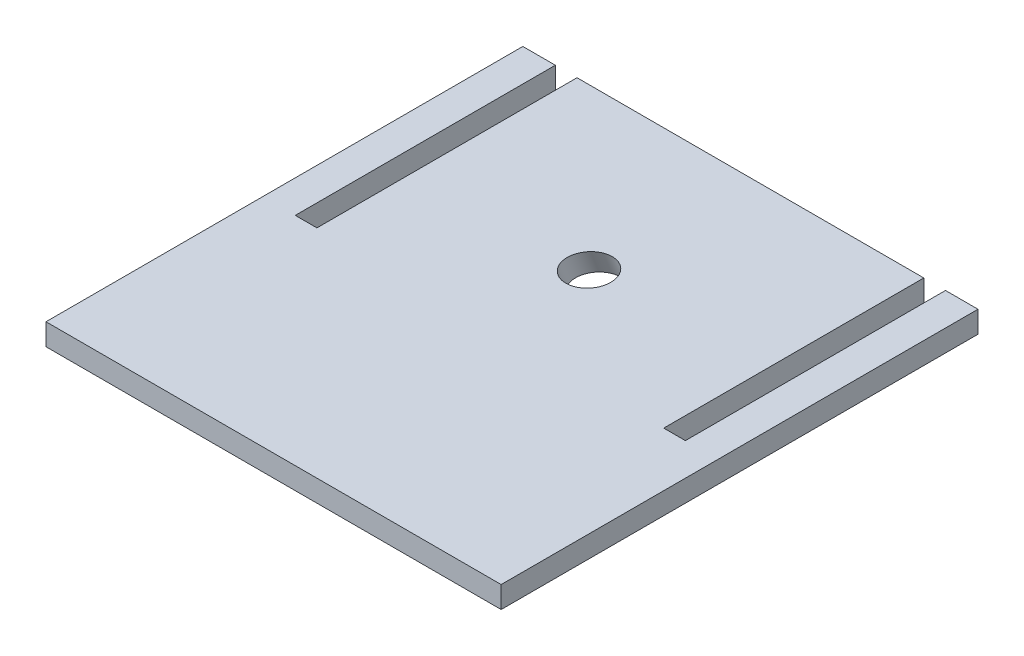
ISO-10303-21;
HEADER;
FILE_DESCRIPTION(('STEP AP214'),'2;1');
FILE_NAME('part.step','',(''),(''),'','','');
FILE_SCHEMA(('AUTOMOTIVE_DESIGN { 1 0 10303 214 1 1 1 1 }'));
ENDSEC;
DATA;
#1=APPLICATION_CONTEXT('core data for automotive mechanical design processes');
#2=APPLICATION_PROTOCOL_DEFINITION('international standard','automotive_design',2000,#1);
#3=PRODUCT_CONTEXT('',#1,'mechanical');
#4=PRODUCT('Part','Part','',(#3));
#5=PRODUCT_RELATED_PRODUCT_CATEGORY('part','',(#4));
#6=PRODUCT_DEFINITION_FORMATION('','',#4);
#7=PRODUCT_DEFINITION_CONTEXT('part definition',#1,'design');
#8=PRODUCT_DEFINITION('design','',#6,#7);
#9=PRODUCT_DEFINITION_SHAPE('','',#8);
#10=(LENGTH_UNIT() NAMED_UNIT(*) SI_UNIT(.MILLI.,.METRE.));
#11=(NAMED_UNIT(*) PLANE_ANGLE_UNIT() SI_UNIT($,.RADIAN.));
#12=(NAMED_UNIT(*) SI_UNIT($,.STERADIAN.) SOLID_ANGLE_UNIT());
#13=UNCERTAINTY_MEASURE_WITH_UNIT(LENGTH_MEASURE(1.E-05),#10,'distance_accuracy_value','');
#14=(GEOMETRIC_REPRESENTATION_CONTEXT(3) GLOBAL_UNCERTAINTY_ASSIGNED_CONTEXT((#13)) GLOBAL_UNIT_ASSIGNED_CONTEXT((#10,
#11,#12)) REPRESENTATION_CONTEXT('',''));
#15=CARTESIAN_POINT('',(0.,0.,0.));
#16=DIRECTION('',(0.,0.,1.));
#17=DIRECTION('',(1.,0.,0.));
#18=AXIS2_PLACEMENT_3D('',#15,#16,#17);
#19=CARTESIAN_POINT('',(-165.1,6.35,-139.7));
#20=DIRECTION('',(0.,0.,1.));
#21=DIRECTION('',(1.,0.,0.));
#22=AXIS2_PLACEMENT_3D('',#19,#20,#21);
#23=PLANE('',#22);
#24=DIRECTION('',(-1.,0.,0.));
#25=VECTOR('',#24,1.);
#26=CARTESIAN_POINT('',(-165.1,-6.35,-139.7));
#27=LINE('',#26,#25);
#28=CARTESIAN_POINT('',(-114.3,-6.35,-139.7));
#29=VERTEX_POINT('',#28);
#30=CARTESIAN_POINT('',(-133.35,-6.35,-139.7));
#31=VERTEX_POINT('',#30);
#32=EDGE_CURVE('E158',#29,#31,#27,.T.);
#33=ORIENTED_EDGE('',*,*,#32,.T.);
#34=DIRECTION('',(0.,1.,0.));
#35=VECTOR('',#34,1.);
#36=CARTESIAN_POINT('',(-133.35,-6.35,-139.7));
#37=LINE('',#36,#35);
#38=CARTESIAN_POINT('',(-133.35,6.35,-139.7));
#39=VERTEX_POINT('',#38);
#40=EDGE_CURVE('E147',#31,#39,#37,.T.);
#41=ORIENTED_EDGE('',*,*,#40,.T.);
#42=DIRECTION('',(-1.,0.,0.));
#43=VECTOR('',#42,1.);
#44=CARTESIAN_POINT('',(-165.1,6.35,-139.7));
#45=LINE('',#44,#43);
#46=CARTESIAN_POINT('',(-114.3,6.35,-139.7));
#47=VERTEX_POINT('',#46);
#48=EDGE_CURVE('E243',#47,#39,#45,.T.);
#49=ORIENTED_EDGE('',*,*,#48,.F.);
#50=DIRECTION('',(0.,1.,0.));
#51=VECTOR('',#50,1.);
#52=CARTESIAN_POINT('',(-114.3,-6.35,-139.7));
#53=LINE('',#52,#51);
#54=EDGE_CURVE('E172',#29,#47,#53,.T.);
#55=ORIENTED_EDGE('',*,*,#54,.F.);
#56=EDGE_LOOP('',(#33,#41,#49,#55));
#57=FACE_BOUND('',#56,.T.);
#58=ADVANCED_FACE('F43',(#57),#23,.F.);
#59=CARTESIAN_POINT('',(133.35,6.35,-139.7));
#60=VERTEX_POINT('',#59);
#61=CARTESIAN_POINT('',(114.3,6.35,-139.7));
#62=VERTEX_POINT('',#61);
#63=EDGE_CURVE('E253',#60,#62,#45,.T.);
#64=ORIENTED_EDGE('',*,*,#63,.F.);
#65=DIRECTION('',(0.,1.,0.));
#66=VECTOR('',#65,1.);
#67=CARTESIAN_POINT('',(133.35,-6.35,-139.7));
#68=LINE('',#67,#66);
#69=CARTESIAN_POINT('',(133.35,-6.35,-139.7));
#70=VERTEX_POINT('',#69);
#71=EDGE_CURVE('E239',#70,#60,#68,.T.);
#72=ORIENTED_EDGE('',*,*,#71,.F.);
#73=CARTESIAN_POINT('',(114.3,-6.35,-139.7));
#74=VERTEX_POINT('',#73);
#75=EDGE_CURVE('E157',#70,#74,#27,.T.);
#76=ORIENTED_EDGE('',*,*,#75,.T.);
#77=DIRECTION('',(0.,1.,0.));
#78=VECTOR('',#77,1.);
#79=CARTESIAN_POINT('',(114.3,-6.35,-139.7));
#80=LINE('',#79,#78);
#81=EDGE_CURVE('E182',#74,#62,#80,.T.);
#82=ORIENTED_EDGE('',*,*,#81,.T.);
#83=EDGE_LOOP('',(#64,#72,#76,#82));
#84=FACE_BOUND('',#83,.T.);
#85=ADVANCED_FACE('F322',(#84),#23,.F.);
#86=CARTESIAN_POINT('',(101.6,-6.35,-139.7));
#87=VERTEX_POINT('',#86);
#88=CARTESIAN_POINT('',(-101.6,-6.35,-139.7));
#89=VERTEX_POINT('',#88);
#90=EDGE_CURVE('E175',#87,#89,#27,.T.);
#91=ORIENTED_EDGE('',*,*,#90,.T.);
#92=DIRECTION('',(0.,1.,0.));
#93=VECTOR('',#92,1.);
#94=CARTESIAN_POINT('',(-101.6,-6.35,-139.7));
#95=LINE('',#94,#93);
#96=CARTESIAN_POINT('',(-101.6,6.35,-139.7));
#97=VERTEX_POINT('',#96);
#98=EDGE_CURVE('E181',#89,#97,#95,.T.);
#99=ORIENTED_EDGE('',*,*,#98,.T.);
#100=CARTESIAN_POINT('',(101.6,6.35,-139.7));
#101=VERTEX_POINT('',#100);
#102=EDGE_CURVE('E255',#101,#97,#45,.T.);
#103=ORIENTED_EDGE('',*,*,#102,.F.);
#104=DIRECTION('',(0.,1.,0.));
#105=VECTOR('',#104,1.);
#106=CARTESIAN_POINT('',(101.6,-6.35,-139.7));
#107=LINE('',#106,#105);
#108=EDGE_CURVE('E196',#87,#101,#107,.T.);
#109=ORIENTED_EDGE('',*,*,#108,.F.);
#110=EDGE_LOOP('',(#91,#99,#103,#109));
#111=FACE_BOUND('',#110,.T.);
#112=ADVANCED_FACE('F300',(#111),#23,.F.);
#113=CARTESIAN_POINT('',(-165.1,6.35,139.7));
#114=DIRECTION('',(0.,0.,-1.));
#115=DIRECTION('',(-1.,0.,0.));
#116=AXIS2_PLACEMENT_3D('',#113,#114,#115);
#117=PLANE('',#116);
#118=DIRECTION('',(1.,0.,0.));
#119=VECTOR('',#118,1.);
#120=CARTESIAN_POINT('',(-165.1,6.35,139.7));
#121=LINE('',#120,#119);
#122=CARTESIAN_POINT('',(-133.35,6.35,139.7));
#123=VERTEX_POINT('',#122);
#124=CARTESIAN_POINT('',(133.35,6.35,139.7));
#125=VERTEX_POINT('',#124);
#126=EDGE_CURVE('E250',#123,#125,#121,.T.);
#127=ORIENTED_EDGE('',*,*,#126,.F.);
#128=DIRECTION('',(0.,1.,0.));
#129=VECTOR('',#128,1.);
#130=CARTESIAN_POINT('',(-133.35,-6.35,139.7));
#131=LINE('',#130,#129);
#132=CARTESIAN_POINT('',(-133.35,-6.35,139.7));
#133=VERTEX_POINT('',#132);
#134=EDGE_CURVE('E53',#133,#123,#131,.T.);
#135=ORIENTED_EDGE('',*,*,#134,.F.);
#136=DIRECTION('',(1.,0.,0.));
#137=VECTOR('',#136,1.);
#138=CARTESIAN_POINT('',(-165.1,-6.35,139.7));
#139=LINE('',#138,#137);
#140=CARTESIAN_POINT('',(133.35,-6.35,139.7));
#141=VERTEX_POINT('',#140);
#142=EDGE_CURVE('E167',#133,#141,#139,.T.);
#143=ORIENTED_EDGE('',*,*,#142,.T.);
#144=DIRECTION('',(0.,1.,0.));
#145=VECTOR('',#144,1.);
#146=CARTESIAN_POINT('',(133.35,-6.35,139.7));
#147=LINE('',#146,#145);
#148=EDGE_CURVE('E240',#141,#125,#147,.T.);
#149=ORIENTED_EDGE('',*,*,#148,.T.);
#150=EDGE_LOOP('',(#127,#135,#143,#149));
#151=FACE_BOUND('',#150,.T.);
#152=ADVANCED_FACE('F329',(#151),#117,.F.);
#153=CARTESIAN_POINT('',(0.,6.35,0.));
#154=DIRECTION('',(0.,-1.,0.));
#155=DIRECTION('',(0.,0.,-1.));
#156=AXIS2_PLACEMENT_3D('',#153,#154,#155);
#157=PLANE('',#156);
#158=CARTESIAN_POINT('',(-0.577885440566899,6.34999999999999,-45.697273091108));
#159=DIRECTION('',(0.,-1.,0.));
#160=DIRECTION('',(-0.0211224465512653,0.,0.9997768962382));
#161=AXIS2_PLACEMENT_3D('',#158,#159,#160);
#162=ELLIPSE('',#161,13.5685983777433,12.7);
#163=CARTESIAN_POINT('',(-0.864487434576367,6.34999999999999,-32.1317019187052));
#164=VERTEX_POINT('',#163);
#165=EDGE_CURVE('E11',#164,#164,#162,.F.);
#166=ORIENTED_EDGE('',*,*,#165,.F.);
#167=EDGE_LOOP('',(#166));
#168=FACE_BOUND('',#167,.T.);
#169=ORIENTED_EDGE('',*,*,#48,.T.);
#170=DIRECTION('',(0.,0.,-1.));
#171=VECTOR('',#170,1.);
#172=CARTESIAN_POINT('',(-133.35,6.35,-139.7));
#173=LINE('',#172,#171);
#174=EDGE_CURVE('E151',#123,#39,#173,.T.);
#175=ORIENTED_EDGE('',*,*,#174,.F.);
#176=ORIENTED_EDGE('',*,*,#126,.T.);
#177=DIRECTION('',(0.,0.,1.));
#178=VECTOR('',#177,1.);
#179=CARTESIAN_POINT('',(133.35,6.35,-139.7));
#180=LINE('',#179,#178);
#181=EDGE_CURVE('E201',#60,#125,#180,.T.);
#182=ORIENTED_EDGE('',*,*,#181,.F.);
#183=ORIENTED_EDGE('',*,*,#63,.T.);
#184=DIRECTION('',(0.,0.,-1.));
#185=VECTOR('',#184,1.);
#186=CARTESIAN_POINT('',(114.3,6.35,-139.7));
#187=LINE('',#186,#185);
#188=CARTESIAN_POINT('',(114.3,6.35,12.7));
#189=VERTEX_POINT('',#188);
#190=EDGE_CURVE('E235',#189,#62,#187,.T.);
#191=ORIENTED_EDGE('',*,*,#190,.F.);
#192=DIRECTION('',(1.,0.,0.));
#193=VECTOR('',#192,1.);
#194=CARTESIAN_POINT('',(114.3,6.35,12.7));
#195=LINE('',#194,#193);
#196=CARTESIAN_POINT('',(101.6,6.35,12.7));
#197=VERTEX_POINT('',#196);
#198=EDGE_CURVE('E276',#197,#189,#195,.T.);
#199=ORIENTED_EDGE('',*,*,#198,.F.);
#200=DIRECTION('',(0.,0.,1.));
#201=VECTOR('',#200,1.);
#202=CARTESIAN_POINT('',(101.6,6.35,-139.7));
#203=LINE('',#202,#201);
#204=EDGE_CURVE('E282',#101,#197,#203,.T.);
#205=ORIENTED_EDGE('',*,*,#204,.F.);
#206=ORIENTED_EDGE('',*,*,#102,.T.);
#207=DIRECTION('',(0.,0.,-1.));
#208=VECTOR('',#207,1.);
#209=CARTESIAN_POINT('',(-101.6,6.35,-139.7));
#210=LINE('',#209,#208);
#211=CARTESIAN_POINT('',(-101.6,6.35,12.7));
#212=VERTEX_POINT('',#211);
#213=EDGE_CURVE('E206',#212,#97,#210,.T.);
#214=ORIENTED_EDGE('',*,*,#213,.F.);
#215=DIRECTION('',(1.,0.,0.));
#216=VECTOR('',#215,1.);
#217=CARTESIAN_POINT('',(-114.3,6.35,12.7));
#218=LINE('',#217,#216);
#219=CARTESIAN_POINT('',(-114.3,6.35,12.7));
#220=VERTEX_POINT('',#219);
#221=EDGE_CURVE('E202',#220,#212,#218,.T.);
#222=ORIENTED_EDGE('',*,*,#221,.F.);
#223=DIRECTION('',(0.,0.,1.));
#224=VECTOR('',#223,1.);
#225=CARTESIAN_POINT('',(-114.3,6.35,-139.7));
#226=LINE('',#225,#224);
#227=EDGE_CURVE('E212',#47,#220,#226,.T.);
#228=ORIENTED_EDGE('',*,*,#227,.F.);
#229=EDGE_LOOP('',(#169,#175,#176,#182,#183,#191,#199,#205,#206,#214,#222,#228));
#230=FACE_BOUND('',#229,.T.);
#231=ADVANCED_FACE('F45',(#168,#230),#157,.F.);
#232=CARTESIAN_POINT('',(0.,-6.35,0.));
#233=DIRECTION('',(0.,-1.,0.));
#234=DIRECTION('',(0.,0.,-1.));
#235=AXIS2_PLACEMENT_3D('',#232,#233,#234);
#236=PLANE('',#235);
#237=CARTESIAN_POINT('',(-0.476989852233649,-6.35,-50.4729072915838));
#238=DIRECTION('',(0.,-1.,0.));
#239=DIRECTION('',(-0.0211224465512653,0.,0.9997768962382));
#240=AXIS2_PLACEMENT_3D('',#237,#238,#239);
#241=ELLIPSE('',#240,13.5685983777433,12.7);
#242=CARTESIAN_POINT('',(-0.763591846243117,-6.35,-36.9073361191809));
#243=VERTEX_POINT('',#242);
#244=EDGE_CURVE('E170',#243,#243,#241,.F.);
#245=ORIENTED_EDGE('',*,*,#244,.T.);
#246=EDGE_LOOP('',(#245));
#247=FACE_BOUND('',#246,.T.);
#248=DIRECTION('',(0.,0.,-1.));
#249=VECTOR('',#248,1.);
#250=CARTESIAN_POINT('',(-133.35,-6.35,-139.7));
#251=LINE('',#250,#249);
#252=EDGE_CURVE('E150',#133,#31,#251,.T.);
#253=ORIENTED_EDGE('',*,*,#252,.T.);
#254=ORIENTED_EDGE('',*,*,#32,.F.);
#255=DIRECTION('',(0.,0.,1.));
#256=VECTOR('',#255,1.);
#257=CARTESIAN_POINT('',(-114.3,-6.35,-139.7));
#258=LINE('',#257,#256);
#259=CARTESIAN_POINT('',(-114.3,-6.35,12.7));
#260=VERTEX_POINT('',#259);
#261=EDGE_CURVE('E169',#29,#260,#258,.T.);
#262=ORIENTED_EDGE('',*,*,#261,.T.);
#263=DIRECTION('',(1.,0.,0.));
#264=VECTOR('',#263,1.);
#265=CARTESIAN_POINT('',(-114.3,-6.35,12.7));
#266=LINE('',#265,#264);
#267=CARTESIAN_POINT('',(-101.6,-6.35,12.7));
#268=VERTEX_POINT('',#267);
#269=EDGE_CURVE('E226',#260,#268,#266,.T.);
#270=ORIENTED_EDGE('',*,*,#269,.T.);
#271=DIRECTION('',(0.,0.,-1.));
#272=VECTOR('',#271,1.);
#273=CARTESIAN_POINT('',(-101.6,-6.35,-139.7));
#274=LINE('',#273,#272);
#275=EDGE_CURVE('E221',#268,#89,#274,.T.);
#276=ORIENTED_EDGE('',*,*,#275,.T.);
#277=ORIENTED_EDGE('',*,*,#90,.F.);
#278=DIRECTION('',(0.,0.,1.));
#279=VECTOR('',#278,1.);
#280=CARTESIAN_POINT('',(101.6,-6.35,-139.7));
#281=LINE('',#280,#279);
#282=CARTESIAN_POINT('',(101.6,-6.35,12.7));
#283=VERTEX_POINT('',#282);
#284=EDGE_CURVE('E225',#87,#283,#281,.T.);
#285=ORIENTED_EDGE('',*,*,#284,.T.);
#286=DIRECTION('',(1.,0.,0.));
#287=VECTOR('',#286,1.);
#288=CARTESIAN_POINT('',(114.3,-6.35,12.7));
#289=LINE('',#288,#287);
#290=CARTESIAN_POINT('',(114.3,-6.35,12.7));
#291=VERTEX_POINT('',#290);
#292=EDGE_CURVE('E280',#283,#291,#289,.T.);
#293=ORIENTED_EDGE('',*,*,#292,.T.);
#294=DIRECTION('',(0.,0.,-1.));
#295=VECTOR('',#294,1.);
#296=CARTESIAN_POINT('',(114.3,-6.35,-139.7));
#297=LINE('',#296,#295);
#298=EDGE_CURVE('E236',#291,#74,#297,.T.);
#299=ORIENTED_EDGE('',*,*,#298,.T.);
#300=ORIENTED_EDGE('',*,*,#75,.F.);
#301=DIRECTION('',(0.,0.,1.));
#302=VECTOR('',#301,1.);
#303=CARTESIAN_POINT('',(133.35,-6.35,-139.7));
#304=LINE('',#303,#302);
#305=EDGE_CURVE('E232',#70,#141,#304,.T.);
#306=ORIENTED_EDGE('',*,*,#305,.T.);
#307=ORIENTED_EDGE('',*,*,#142,.F.);
#308=EDGE_LOOP('',(#253,#254,#262,#270,#276,#277,#285,#293,#299,#300,#306,#307));
#309=FACE_BOUND('',#308,.T.);
#310=ADVANCED_FACE('F163',(#247,#309),#236,.T.);
#311=CARTESIAN_POINT('',(114.3,-6.35,-139.7));
#312=DIRECTION('',(1.,0.,0.));
#313=DIRECTION('',(0.,0.,-1.));
#314=AXIS2_PLACEMENT_3D('',#311,#312,#313);
#315=PLANE('',#314);
#316=ORIENTED_EDGE('',*,*,#190,.T.);
#317=ORIENTED_EDGE('',*,*,#81,.F.);
#318=ORIENTED_EDGE('',*,*,#298,.F.);
#319=DIRECTION('',(0.,1.,0.));
#320=VECTOR('',#319,1.);
#321=CARTESIAN_POINT('',(114.3,-6.35,12.7));
#322=LINE('',#321,#320);
#323=EDGE_CURVE('E272',#291,#189,#322,.T.);
#324=ORIENTED_EDGE('',*,*,#323,.T.);
#325=EDGE_LOOP('',(#316,#317,#318,#324));
#326=FACE_BOUND('',#325,.T.);
#327=ADVANCED_FACE('F269',(#326),#315,.F.);
#328=CARTESIAN_POINT('',(114.3,-6.35,12.7));
#329=DIRECTION('',(0.,0.,1.));
#330=DIRECTION('',(1.,0.,0.));
#331=AXIS2_PLACEMENT_3D('',#328,#329,#330);
#332=PLANE('',#331);
#333=ORIENTED_EDGE('',*,*,#198,.T.);
#334=ORIENTED_EDGE('',*,*,#323,.F.);
#335=ORIENTED_EDGE('',*,*,#292,.F.);
#336=DIRECTION('',(0.,1.,0.));
#337=VECTOR('',#336,1.);
#338=CARTESIAN_POINT('',(101.6,-6.35,12.7));
#339=LINE('',#338,#337);
#340=EDGE_CURVE('E286',#283,#197,#339,.T.);
#341=ORIENTED_EDGE('',*,*,#340,.T.);
#342=EDGE_LOOP('',(#333,#334,#335,#341));
#343=FACE_BOUND('',#342,.T.);
#344=ADVANCED_FACE('F290',(#343),#332,.F.);
#345=CARTESIAN_POINT('',(101.6,-6.35,-139.7));
#346=DIRECTION('',(-1.,0.,0.));
#347=DIRECTION('',(0.,0.,1.));
#348=AXIS2_PLACEMENT_3D('',#345,#346,#347);
#349=PLANE('',#348);
#350=ORIENTED_EDGE('',*,*,#204,.T.);
#351=ORIENTED_EDGE('',*,*,#340,.F.);
#352=ORIENTED_EDGE('',*,*,#284,.F.);
#353=ORIENTED_EDGE('',*,*,#108,.T.);
#354=EDGE_LOOP('',(#350,#351,#352,#353));
#355=FACE_BOUND('',#354,.T.);
#356=ADVANCED_FACE('F295',(#355),#349,.F.);
#357=CARTESIAN_POINT('',(-114.3,-6.35,-139.7));
#358=DIRECTION('',(-1.,0.,0.));
#359=DIRECTION('',(0.,0.,1.));
#360=AXIS2_PLACEMENT_3D('',#357,#358,#359);
#361=PLANE('',#360);
#362=ORIENTED_EDGE('',*,*,#227,.T.);
#363=DIRECTION('',(0.,1.,0.));
#364=VECTOR('',#363,1.);
#365=CARTESIAN_POINT('',(-114.3,-6.35,12.7));
#366=LINE('',#365,#364);
#367=EDGE_CURVE('E198',#260,#220,#366,.T.);
#368=ORIENTED_EDGE('',*,*,#367,.F.);
#369=ORIENTED_EDGE('',*,*,#261,.F.);
#370=ORIENTED_EDGE('',*,*,#54,.T.);
#371=EDGE_LOOP('',(#362,#368,#369,#370));
#372=FACE_BOUND('',#371,.T.);
#373=ADVANCED_FACE('F310',(#372),#361,.F.);
#374=CARTESIAN_POINT('',(-101.6,-6.35,-139.7));
#375=DIRECTION('',(1.,0.,0.));
#376=DIRECTION('',(0.,0.,-1.));
#377=AXIS2_PLACEMENT_3D('',#374,#375,#376);
#378=PLANE('',#377);
#379=ORIENTED_EDGE('',*,*,#213,.T.);
#380=ORIENTED_EDGE('',*,*,#98,.F.);
#381=ORIENTED_EDGE('',*,*,#275,.F.);
#382=DIRECTION('',(0.,1.,0.));
#383=VECTOR('',#382,1.);
#384=CARTESIAN_POINT('',(-101.6,-6.35,12.7));
#385=LINE('',#384,#383);
#386=EDGE_CURVE('E203',#268,#212,#385,.T.);
#387=ORIENTED_EDGE('',*,*,#386,.T.);
#388=EDGE_LOOP('',(#379,#380,#381,#387));
#389=FACE_BOUND('',#388,.T.);
#390=ADVANCED_FACE('F303',(#389),#378,.F.);
#391=CARTESIAN_POINT('',(-114.3,-6.35,12.7));
#392=DIRECTION('',(0.,0.,1.));
#393=DIRECTION('',(1.,0.,0.));
#394=AXIS2_PLACEMENT_3D('',#391,#392,#393);
#395=PLANE('',#394);
#396=ORIENTED_EDGE('',*,*,#221,.T.);
#397=ORIENTED_EDGE('',*,*,#386,.F.);
#398=ORIENTED_EDGE('',*,*,#269,.F.);
#399=ORIENTED_EDGE('',*,*,#367,.T.);
#400=EDGE_LOOP('',(#396,#397,#398,#399));
#401=FACE_BOUND('',#400,.T.);
#402=ADVANCED_FACE('F307',(#401),#395,.F.);
#403=CARTESIAN_POINT('',(133.35,-6.35,-139.7));
#404=DIRECTION('',(-1.,0.,0.));
#405=DIRECTION('',(0.,0.,1.));
#406=AXIS2_PLACEMENT_3D('',#403,#404,#405);
#407=PLANE('',#406);
#408=ORIENTED_EDGE('',*,*,#181,.T.);
#409=ORIENTED_EDGE('',*,*,#148,.F.);
#410=ORIENTED_EDGE('',*,*,#305,.F.);
#411=ORIENTED_EDGE('',*,*,#71,.T.);
#412=EDGE_LOOP('',(#408,#409,#410,#411));
#413=FACE_BOUND('',#412,.T.);
#414=ADVANCED_FACE('F356',(#413),#407,.F.);
#415=CARTESIAN_POINT('',(-133.35,-6.35,-139.7));
#416=DIRECTION('',(1.,0.,0.));
#417=DIRECTION('',(0.,0.,-1.));
#418=AXIS2_PLACEMENT_3D('',#415,#416,#417);
#419=PLANE('',#418);
#420=ORIENTED_EDGE('',*,*,#174,.T.);
#421=ORIENTED_EDGE('',*,*,#40,.F.);
#422=ORIENTED_EDGE('',*,*,#252,.F.);
#423=ORIENTED_EDGE('',*,*,#134,.T.);
#424=EDGE_LOOP('',(#420,#421,#422,#423));
#425=FACE_BOUND('',#424,.T.);
#426=ADVANCED_FACE('F149',(#425),#419,.F.);
#427=CARTESIAN_POINT('',(1.32116539930394E-11,-66.3900000000675,-73.0500000000001));
#428=DIRECTION('',(-0.00743596247190496,0.935984664475875,0.351962234235576));
#429=DIRECTION('',(0.,-0.351971965257692,0.936010542500798));
#430=AXIS2_PLACEMENT_3D('',#427,#428,#429);
#431=CYLINDRICAL_SURFACE('',#430,12.7);
#432=ORIENTED_EDGE('',*,*,#244,.F.);
#433=EDGE_LOOP('',(#432));
#434=FACE_BOUND('',#433,.T.);
#435=ORIENTED_EDGE('',*,*,#165,.T.);
#436=EDGE_LOOP('',(#435));
#437=FACE_BOUND('',#436,.T.);
#438=ADVANCED_FACE('F350',(#434,#437),#431,.F.);
#439=CLOSED_SHELL('',(#58,#85,#112,#152,#231,#310,#327,#344,#356,#373,#390,#402,#414,#426,#438));
#440=MANIFOLD_SOLID_BREP('B2',#439);
#441=ADVANCED_BREP_SHAPE_REPRESENTATION('',(#18,#440),#14);
#442=SHAPE_DEFINITION_REPRESENTATION(#9,#441);
ENDSEC;
END-ISO-10303-21;
